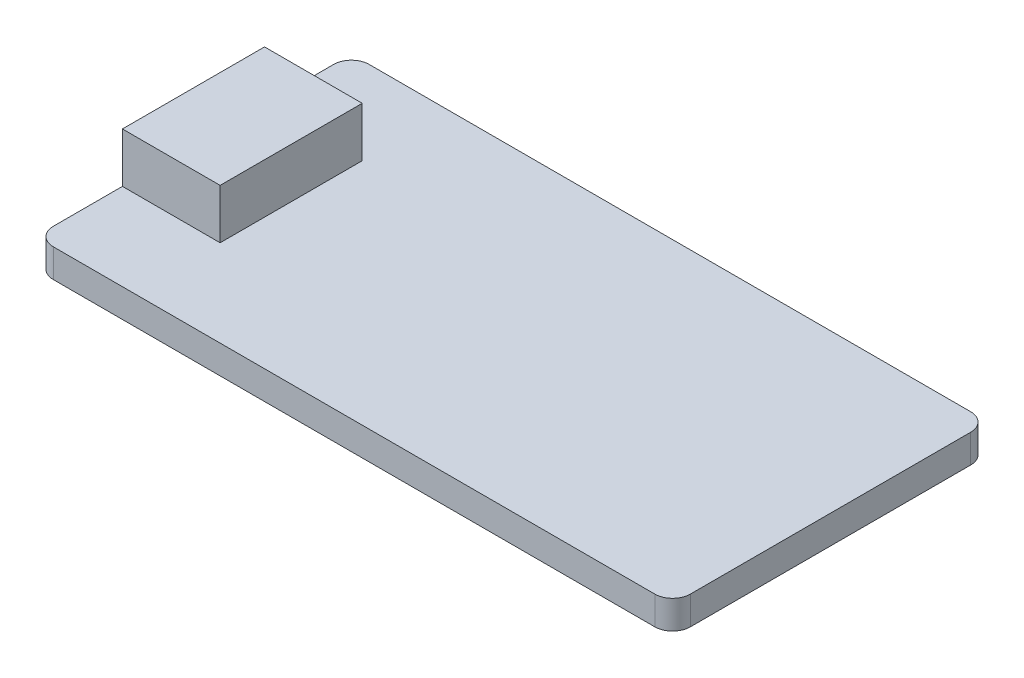
ISO-10303-21;
HEADER;
FILE_DESCRIPTION(('STEP AP214'),'2;1');
FILE_NAME('part.step','',(''),(''),'','','');
FILE_SCHEMA(('AUTOMOTIVE_DESIGN { 1 0 10303 214 1 1 1 1 }'));
ENDSEC;
DATA;
#1=APPLICATION_CONTEXT('core data for automotive mechanical design processes');
#2=APPLICATION_PROTOCOL_DEFINITION('international standard','automotive_design',2000,#1);
#3=PRODUCT_CONTEXT('',#1,'mechanical');
#4=PRODUCT('Part','Part','',(#3));
#5=PRODUCT_RELATED_PRODUCT_CATEGORY('part','',(#4));
#6=PRODUCT_DEFINITION_FORMATION('','',#4);
#7=PRODUCT_DEFINITION_CONTEXT('part definition',#1,'design');
#8=PRODUCT_DEFINITION('design','',#6,#7);
#9=PRODUCT_DEFINITION_SHAPE('','',#8);
#10=(LENGTH_UNIT() NAMED_UNIT(*) SI_UNIT(.MILLI.,.METRE.));
#11=(NAMED_UNIT(*) PLANE_ANGLE_UNIT() SI_UNIT($,.RADIAN.));
#12=(NAMED_UNIT(*) SI_UNIT($,.STERADIAN.) SOLID_ANGLE_UNIT());
#13=UNCERTAINTY_MEASURE_WITH_UNIT(LENGTH_MEASURE(1.E-05),#10,'distance_accuracy_value','');
#14=(GEOMETRIC_REPRESENTATION_CONTEXT(3) GLOBAL_UNCERTAINTY_ASSIGNED_CONTEXT((#13)) GLOBAL_UNIT_ASSIGNED_CONTEXT((#10,
#11,#12)) REPRESENTATION_CONTEXT('',''));
#15=CARTESIAN_POINT('',(0.,0.,0.));
#16=DIRECTION('',(0.,0.,1.));
#17=DIRECTION('',(1.,0.,0.));
#18=AXIS2_PLACEMENT_3D('',#15,#16,#17);
#19=CARTESIAN_POINT('',(0.,1.6,0.));
#20=DIRECTION('',(1.,0.,0.));
#21=DIRECTION('',(0.,0.,-1.));
#22=AXIS2_PLACEMENT_3D('',#19,#20,#21);
#23=PLANE('',#22);
#24=DIRECTION('',(0.,0.,1.));
#25=VECTOR('',#24,1.);
#26=CARTESIAN_POINT('',(0.,1.6,0.));
#27=LINE('',#26,#25);
#28=CARTESIAN_POINT('',(0.,1.6,-16.78));
#29=VERTEX_POINT('',#28);
#30=CARTESIAN_POINT('',(0.,1.6,-12.89));
#31=VERTEX_POINT('',#30);
#32=EDGE_CURVE('E159',#29,#31,#27,.T.);
#33=ORIENTED_EDGE('',*,*,#32,.F.);
#34=DIRECTION('',(0.,-1.,0.));
#35=VECTOR('',#34,1.);
#36=CARTESIAN_POINT('',(0.,1.6,-16.78));
#37=LINE('',#36,#35);
#38=CARTESIAN_POINT('',(0.,0.,-16.78));
#39=VERTEX_POINT('',#38);
#40=EDGE_CURVE('E177',#29,#39,#37,.T.);
#41=ORIENTED_EDGE('',*,*,#40,.T.);
#42=DIRECTION('',(0.,0.,1.));
#43=VECTOR('',#42,1.);
#44=CARTESIAN_POINT('',(0.,0.,0.));
#45=LINE('',#44,#43);
#46=CARTESIAN_POINT('',(0.,0.,-1.));
#47=VERTEX_POINT('',#46);
#48=EDGE_CURVE('E150',#39,#47,#45,.T.);
#49=ORIENTED_EDGE('',*,*,#48,.T.);
#50=DIRECTION('',(0.,-1.,0.));
#51=VECTOR('',#50,1.);
#52=CARTESIAN_POINT('',(0.,1.6,-1.));
#53=LINE('',#52,#51);
#54=CARTESIAN_POINT('',(0.,1.6,-1.));
#55=VERTEX_POINT('',#54);
#56=EDGE_CURVE('E167',#47,#55,#53,.F.);
#57=ORIENTED_EDGE('',*,*,#56,.T.);
#58=CARTESIAN_POINT('',(0.,1.6,-4.88999999999999));
#59=VERTEX_POINT('',#58);
#60=EDGE_CURVE('E149',#59,#55,#27,.T.);
#61=ORIENTED_EDGE('',*,*,#60,.F.);
#62=DIRECTION('',(0.,-1.,0.));
#63=VECTOR('',#62,1.);
#64=CARTESIAN_POINT('',(0.,4.4,-4.88999999999999));
#65=LINE('',#64,#63);
#66=CARTESIAN_POINT('',(0.,4.4,-4.88999999999999));
#67=VERTEX_POINT('',#66);
#68=EDGE_CURVE('E128',#67,#59,#65,.T.);
#69=ORIENTED_EDGE('',*,*,#68,.F.);
#70=DIRECTION('',(0.,0.,1.));
#71=VECTOR('',#70,1.);
#72=CARTESIAN_POINT('',(0.,4.4,-12.89));
#73=LINE('',#72,#71);
#74=CARTESIAN_POINT('',(0.,4.4,-12.89));
#75=VERTEX_POINT('',#74);
#76=EDGE_CURVE('E135',#75,#67,#73,.T.);
#77=ORIENTED_EDGE('',*,*,#76,.F.);
#78=DIRECTION('',(0.,-1.,0.));
#79=VECTOR('',#78,1.);
#80=CARTESIAN_POINT('',(0.,4.4,-12.89));
#81=LINE('',#80,#79);
#82=EDGE_CURVE('E235',#75,#31,#81,.T.);
#83=ORIENTED_EDGE('',*,*,#82,.T.);
#84=EDGE_LOOP('',(#33,#41,#49,#57,#61,#69,#77,#83));
#85=FACE_BOUND('',#84,.T.);
#86=ADVANCED_FACE('F33',(#85),#23,.F.);
#87=CARTESIAN_POINT('',(0.,1.6,0.));
#88=DIRECTION('',(0.,0.,-1.));
#89=DIRECTION('',(-1.,0.,0.));
#90=AXIS2_PLACEMENT_3D('',#87,#88,#89);
#91=PLANE('',#90);
#92=DIRECTION('',(1.,0.,0.));
#93=VECTOR('',#92,1.);
#94=CARTESIAN_POINT('',(0.,0.,0.));
#95=LINE('',#94,#93);
#96=CARTESIAN_POINT('',(1.,0.,0.));
#97=VERTEX_POINT('',#96);
#98=CARTESIAN_POINT('',(34.86,0.,0.));
#99=VERTEX_POINT('',#98);
#100=EDGE_CURVE('E153',#97,#99,#95,.T.);
#101=ORIENTED_EDGE('',*,*,#100,.T.);
#102=DIRECTION('',(0.,-1.,0.));
#103=VECTOR('',#102,1.);
#104=CARTESIAN_POINT('',(34.86,1.6,0.));
#105=LINE('',#104,#103);
#106=CARTESIAN_POINT('',(34.86,1.6,0.));
#107=VERTEX_POINT('',#106);
#108=EDGE_CURVE('E11',#99,#107,#105,.F.);
#109=ORIENTED_EDGE('',*,*,#108,.T.);
#110=DIRECTION('',(1.,0.,0.));
#111=VECTOR('',#110,1.);
#112=CARTESIAN_POINT('',(0.,1.6,0.));
#113=LINE('',#112,#111);
#114=CARTESIAN_POINT('',(1.,1.6,0.));
#115=VERTEX_POINT('',#114);
#116=EDGE_CURVE('E161',#115,#107,#113,.T.);
#117=ORIENTED_EDGE('',*,*,#116,.F.);
#118=DIRECTION('',(0.,-1.,0.));
#119=VECTOR('',#118,1.);
#120=CARTESIAN_POINT('',(1.,1.6,0.));
#121=LINE('',#120,#119);
#122=EDGE_CURVE('E41',#115,#97,#121,.T.);
#123=ORIENTED_EDGE('',*,*,#122,.T.);
#124=EDGE_LOOP('',(#101,#109,#117,#123));
#125=FACE_BOUND('',#124,.T.);
#126=ADVANCED_FACE('F208',(#125),#91,.F.);
#127=CARTESIAN_POINT('',(35.86,1.6,0.));
#128=DIRECTION('',(-1.,0.,0.));
#129=DIRECTION('',(0.,0.,1.));
#130=AXIS2_PLACEMENT_3D('',#127,#128,#129);
#131=PLANE('',#130);
#132=DIRECTION('',(0.,0.,-1.));
#133=VECTOR('',#132,1.);
#134=CARTESIAN_POINT('',(35.86,0.,0.));
#135=LINE('',#134,#133);
#136=CARTESIAN_POINT('',(35.86,0.,-1.));
#137=VERTEX_POINT('',#136);
#138=CARTESIAN_POINT('',(35.86,0.,-16.78));
#139=VERTEX_POINT('',#138);
#140=EDGE_CURVE('E171',#137,#139,#135,.T.);
#141=ORIENTED_EDGE('',*,*,#140,.T.);
#142=DIRECTION('',(0.,-1.,0.));
#143=VECTOR('',#142,1.);
#144=CARTESIAN_POINT('',(35.86,1.6,-16.78));
#145=LINE('',#144,#143);
#146=CARTESIAN_POINT('',(35.86,1.6,-16.78));
#147=VERTEX_POINT('',#146);
#148=EDGE_CURVE('E48',#139,#147,#145,.F.);
#149=ORIENTED_EDGE('',*,*,#148,.T.);
#150=DIRECTION('',(0.,0.,-1.));
#151=VECTOR('',#150,1.);
#152=CARTESIAN_POINT('',(35.86,1.6,0.));
#153=LINE('',#152,#151);
#154=CARTESIAN_POINT('',(35.86,1.6,-1.));
#155=VERTEX_POINT('',#154);
#156=EDGE_CURVE('E163',#155,#147,#153,.T.);
#157=ORIENTED_EDGE('',*,*,#156,.F.);
#158=DIRECTION('',(0.,-1.,0.));
#159=VECTOR('',#158,1.);
#160=CARTESIAN_POINT('',(35.86,1.6,-1.));
#161=LINE('',#160,#159);
#162=EDGE_CURVE('E200',#155,#137,#161,.T.);
#163=ORIENTED_EDGE('',*,*,#162,.T.);
#164=EDGE_LOOP('',(#141,#149,#157,#163));
#165=FACE_BOUND('',#164,.T.);
#166=ADVANCED_FACE('F219',(#165),#131,.F.);
#167=CARTESIAN_POINT('',(0.,1.6,-17.78));
#168=DIRECTION('',(0.,0.,1.));
#169=DIRECTION('',(1.,0.,0.));
#170=AXIS2_PLACEMENT_3D('',#167,#168,#169);
#171=PLANE('',#170);
#172=DIRECTION('',(-1.,0.,0.));
#173=VECTOR('',#172,1.);
#174=CARTESIAN_POINT('',(0.,0.,-17.78));
#175=LINE('',#174,#173);
#176=CARTESIAN_POINT('',(34.86,0.,-17.78));
#177=VERTEX_POINT('',#176);
#178=CARTESIAN_POINT('',(1.,0.,-17.78));
#179=VERTEX_POINT('',#178);
#180=EDGE_CURVE('E173',#177,#179,#175,.T.);
#181=ORIENTED_EDGE('',*,*,#180,.T.);
#182=DIRECTION('',(0.,-1.,0.));
#183=VECTOR('',#182,1.);
#184=CARTESIAN_POINT('',(1.,1.6,-17.78));
#185=LINE('',#184,#183);
#186=CARTESIAN_POINT('',(1.,1.6,-17.78));
#187=VERTEX_POINT('',#186);
#188=EDGE_CURVE('E191',#179,#187,#185,.F.);
#189=ORIENTED_EDGE('',*,*,#188,.T.);
#190=DIRECTION('',(-1.,0.,0.));
#191=VECTOR('',#190,1.);
#192=CARTESIAN_POINT('',(0.,1.6,-17.78));
#193=LINE('',#192,#191);
#194=CARTESIAN_POINT('',(34.86,1.6,-17.78));
#195=VERTEX_POINT('',#194);
#196=EDGE_CURVE('E165',#195,#187,#193,.T.);
#197=ORIENTED_EDGE('',*,*,#196,.F.);
#198=DIRECTION('',(0.,-1.,0.));
#199=VECTOR('',#198,1.);
#200=CARTESIAN_POINT('',(34.86,1.6,-17.78));
#201=LINE('',#200,#199);
#202=EDGE_CURVE('E188',#195,#177,#201,.T.);
#203=ORIENTED_EDGE('',*,*,#202,.T.);
#204=EDGE_LOOP('',(#181,#189,#197,#203));
#205=FACE_BOUND('',#204,.T.);
#206=ADVANCED_FACE('F228',(#205),#171,.F.);
#207=CARTESIAN_POINT('',(0.,1.6,0.));
#208=DIRECTION('',(0.,-1.,0.));
#209=DIRECTION('',(0.,0.,-1.));
#210=AXIS2_PLACEMENT_3D('',#207,#208,#209);
#211=PLANE('',#210);
#212=ORIENTED_EDGE('',*,*,#196,.T.);
#213=CARTESIAN_POINT('',(1.,1.6,-16.78));
#214=DIRECTION('',(0.,-1.,0.));
#215=DIRECTION('',(0.,0.,-1.));
#216=AXIS2_PLACEMENT_3D('',#213,#214,#215);
#217=CIRCLE('',#216,1.);
#218=EDGE_CURVE('E198',#187,#29,#217,.F.);
#219=ORIENTED_EDGE('',*,*,#218,.T.);
#220=ORIENTED_EDGE('',*,*,#32,.T.);
#221=DIRECTION('',(1.,0.,0.));
#222=VECTOR('',#221,1.);
#223=CARTESIAN_POINT('',(0.,1.6,-12.89));
#224=LINE('',#223,#222);
#225=CARTESIAN_POINT('',(5.5,1.6,-12.89));
#226=VERTEX_POINT('',#225);
#227=EDGE_CURVE('E144',#31,#226,#224,.T.);
#228=ORIENTED_EDGE('',*,*,#227,.T.);
#229=DIRECTION('',(0.,0.,1.));
#230=VECTOR('',#229,1.);
#231=CARTESIAN_POINT('',(5.5,1.6,-12.89));
#232=LINE('',#231,#230);
#233=CARTESIAN_POINT('',(5.5,1.6,-4.89));
#234=VERTEX_POINT('',#233);
#235=EDGE_CURVE('E239',#226,#234,#232,.T.);
#236=ORIENTED_EDGE('',*,*,#235,.T.);
#237=DIRECTION('',(1.,0.,0.));
#238=VECTOR('',#237,1.);
#239=CARTESIAN_POINT('',(0.,1.6,-4.88999999999999));
#240=LINE('',#239,#238);
#241=EDGE_CURVE('E245',#59,#234,#240,.T.);
#242=ORIENTED_EDGE('',*,*,#241,.F.);
#243=ORIENTED_EDGE('',*,*,#60,.T.);
#244=CARTESIAN_POINT('',(1.,1.6,-1.));
#245=DIRECTION('',(0.,-1.,0.));
#246=DIRECTION('',(0.,0.,-1.));
#247=AXIS2_PLACEMENT_3D('',#244,#245,#246);
#248=CIRCLE('',#247,1.);
#249=EDGE_CURVE('E193',#55,#115,#248,.F.);
#250=ORIENTED_EDGE('',*,*,#249,.T.);
#251=ORIENTED_EDGE('',*,*,#116,.T.);
#252=CARTESIAN_POINT('',(34.86,1.6,-1.));
#253=DIRECTION('',(0.,-1.,0.));
#254=DIRECTION('',(0.,0.,-1.));
#255=AXIS2_PLACEMENT_3D('',#252,#253,#254);
#256=CIRCLE('',#255,1.);
#257=EDGE_CURVE('E55',#107,#155,#256,.F.);
#258=ORIENTED_EDGE('',*,*,#257,.T.);
#259=ORIENTED_EDGE('',*,*,#156,.T.);
#260=CARTESIAN_POINT('',(34.86,1.6,-16.78));
#261=DIRECTION('',(0.,-1.,0.));
#262=DIRECTION('',(0.,0.,-1.));
#263=AXIS2_PLACEMENT_3D('',#260,#261,#262);
#264=CIRCLE('',#263,1.);
#265=EDGE_CURVE('E196',#147,#195,#264,.F.);
#266=ORIENTED_EDGE('',*,*,#265,.T.);
#267=EDGE_LOOP('',(#212,#219,#220,#228,#236,#242,#243,#250,#251,#258,#259,#266));
#268=FACE_BOUND('',#267,.T.);
#269=ADVANCED_FACE('F221',(#268),#211,.F.);
#270=CARTESIAN_POINT('',(0.,0.,0.));
#271=DIRECTION('',(0.,-1.,0.));
#272=DIRECTION('',(0.,0.,-1.));
#273=AXIS2_PLACEMENT_3D('',#270,#271,#272);
#274=PLANE('',#273);
#275=ORIENTED_EDGE('',*,*,#48,.F.);
#276=CARTESIAN_POINT('',(1.,0.,-16.78));
#277=DIRECTION('',(0.,-1.,0.));
#278=DIRECTION('',(0.,0.,-1.));
#279=AXIS2_PLACEMENT_3D('',#276,#277,#278);
#280=CIRCLE('',#279,1.);
#281=EDGE_CURVE('E186',#39,#179,#280,.T.);
#282=ORIENTED_EDGE('',*,*,#281,.T.);
#283=ORIENTED_EDGE('',*,*,#180,.F.);
#284=CARTESIAN_POINT('',(34.86,0.,-16.78));
#285=DIRECTION('',(0.,-1.,0.));
#286=DIRECTION('',(0.,0.,-1.));
#287=AXIS2_PLACEMENT_3D('',#284,#285,#286);
#288=CIRCLE('',#287,1.);
#289=EDGE_CURVE('E184',#177,#139,#288,.T.);
#290=ORIENTED_EDGE('',*,*,#289,.T.);
#291=ORIENTED_EDGE('',*,*,#140,.F.);
#292=CARTESIAN_POINT('',(34.86,0.,-1.));
#293=DIRECTION('',(0.,-1.,0.));
#294=DIRECTION('',(0.,0.,-1.));
#295=AXIS2_PLACEMENT_3D('',#292,#293,#294);
#296=CIRCLE('',#295,1.);
#297=EDGE_CURVE('E182',#137,#99,#296,.T.);
#298=ORIENTED_EDGE('',*,*,#297,.T.);
#299=ORIENTED_EDGE('',*,*,#100,.F.);
#300=CARTESIAN_POINT('',(1.,0.,-1.));
#301=DIRECTION('',(0.,-1.,0.));
#302=DIRECTION('',(0.,0.,-1.));
#303=AXIS2_PLACEMENT_3D('',#300,#301,#302);
#304=CIRCLE('',#303,1.);
#305=EDGE_CURVE('E180',#97,#47,#304,.T.);
#306=ORIENTED_EDGE('',*,*,#305,.T.);
#307=EDGE_LOOP('',(#275,#282,#283,#290,#291,#298,#299,#306));
#308=FACE_BOUND('',#307,.T.);
#309=ADVANCED_FACE('F214',(#308),#274,.T.);
#310=CARTESIAN_POINT('',(0.,4.4,-4.88999999999999));
#311=DIRECTION('',(0.,0.,-1.));
#312=DIRECTION('',(-1.,0.,0.));
#313=AXIS2_PLACEMENT_3D('',#310,#311,#312);
#314=PLANE('',#313);
#315=ORIENTED_EDGE('',*,*,#241,.T.);
#316=DIRECTION('',(0.,-1.,0.));
#317=VECTOR('',#316,1.);
#318=CARTESIAN_POINT('',(5.5,4.4,-4.89));
#319=LINE('',#318,#317);
#320=CARTESIAN_POINT('',(5.5,4.4,-4.89));
#321=VERTEX_POINT('',#320);
#322=EDGE_CURVE('E130',#321,#234,#319,.T.);
#323=ORIENTED_EDGE('',*,*,#322,.F.);
#324=DIRECTION('',(1.,0.,0.));
#325=VECTOR('',#324,1.);
#326=CARTESIAN_POINT('',(0.,4.4,-4.88999999999999));
#327=LINE('',#326,#325);
#328=EDGE_CURVE('E123',#67,#321,#327,.T.);
#329=ORIENTED_EDGE('',*,*,#328,.F.);
#330=ORIENTED_EDGE('',*,*,#68,.T.);
#331=EDGE_LOOP('',(#315,#323,#329,#330));
#332=FACE_BOUND('',#331,.T.);
#333=ADVANCED_FACE('F126',(#332),#314,.F.);
#334=CARTESIAN_POINT('',(5.5,4.4,-12.89));
#335=DIRECTION('',(1.,0.,0.));
#336=DIRECTION('',(0.,0.,-1.));
#337=AXIS2_PLACEMENT_3D('',#334,#335,#336);
#338=PLANE('',#337);
#339=ORIENTED_EDGE('',*,*,#235,.F.);
#340=DIRECTION('',(0.,-1.,0.));
#341=VECTOR('',#340,1.);
#342=CARTESIAN_POINT('',(5.5,4.4,-12.89));
#343=LINE('',#342,#341);
#344=CARTESIAN_POINT('',(5.5,4.4,-12.89));
#345=VERTEX_POINT('',#344);
#346=EDGE_CURVE('E155',#345,#226,#343,.T.);
#347=ORIENTED_EDGE('',*,*,#346,.F.);
#348=DIRECTION('',(0.,0.,1.));
#349=VECTOR('',#348,1.);
#350=CARTESIAN_POINT('',(5.5,4.4,-12.89));
#351=LINE('',#350,#349);
#352=EDGE_CURVE('E134',#345,#321,#351,.T.);
#353=ORIENTED_EDGE('',*,*,#352,.T.);
#354=ORIENTED_EDGE('',*,*,#322,.T.);
#355=EDGE_LOOP('',(#339,#347,#353,#354));
#356=FACE_BOUND('',#355,.T.);
#357=ADVANCED_FACE('F244',(#356),#338,.T.);
#358=CARTESIAN_POINT('',(0.,4.4,-12.89));
#359=DIRECTION('',(0.,0.,-1.));
#360=DIRECTION('',(-1.,0.,0.));
#361=AXIS2_PLACEMENT_3D('',#358,#359,#360);
#362=PLANE('',#361);
#363=ORIENTED_EDGE('',*,*,#227,.F.);
#364=ORIENTED_EDGE('',*,*,#82,.F.);
#365=DIRECTION('',(1.,0.,0.));
#366=VECTOR('',#365,1.);
#367=CARTESIAN_POINT('',(0.,4.4,-12.89));
#368=LINE('',#367,#366);
#369=EDGE_CURVE('E141',#75,#345,#368,.T.);
#370=ORIENTED_EDGE('',*,*,#369,.T.);
#371=ORIENTED_EDGE('',*,*,#346,.T.);
#372=EDGE_LOOP('',(#363,#364,#370,#371));
#373=FACE_BOUND('',#372,.T.);
#374=ADVANCED_FACE('F242',(#373),#362,.T.);
#375=CARTESIAN_POINT('',(0.,4.4,0.));
#376=DIRECTION('',(0.,1.,0.));
#377=DIRECTION('',(0.,0.,1.));
#378=AXIS2_PLACEMENT_3D('',#375,#376,#377);
#379=PLANE('',#378);
#380=ORIENTED_EDGE('',*,*,#76,.T.);
#381=ORIENTED_EDGE('',*,*,#328,.T.);
#382=ORIENTED_EDGE('',*,*,#352,.F.);
#383=ORIENTED_EDGE('',*,*,#369,.F.);
#384=EDGE_LOOP('',(#380,#381,#382,#383));
#385=FACE_BOUND('',#384,.T.);
#386=ADVANCED_FACE('F139',(#385),#379,.T.);
#387=CARTESIAN_POINT('',(1.,1.6,-16.78));
#388=DIRECTION('',(0.,-1.,0.));
#389=DIRECTION('',(0.,0.,-1.));
#390=AXIS2_PLACEMENT_3D('',#387,#388,#389);
#391=CYLINDRICAL_SURFACE('',#390,1.);
#392=ORIENTED_EDGE('',*,*,#218,.F.);
#393=ORIENTED_EDGE('',*,*,#188,.F.);
#394=ORIENTED_EDGE('',*,*,#281,.F.);
#395=ORIENTED_EDGE('',*,*,#40,.F.);
#396=EDGE_LOOP('',(#392,#393,#394,#395));
#397=FACE_BOUND('',#396,.T.);
#398=ADVANCED_FACE('F233',(#397),#391,.T.);
#399=CARTESIAN_POINT('',(34.86,1.6,-16.78));
#400=DIRECTION('',(0.,-1.,0.));
#401=DIRECTION('',(0.,0.,-1.));
#402=AXIS2_PLACEMENT_3D('',#399,#400,#401);
#403=CYLINDRICAL_SURFACE('',#402,1.);
#404=ORIENTED_EDGE('',*,*,#265,.F.);
#405=ORIENTED_EDGE('',*,*,#148,.F.);
#406=ORIENTED_EDGE('',*,*,#289,.F.);
#407=ORIENTED_EDGE('',*,*,#202,.F.);
#408=EDGE_LOOP('',(#404,#405,#406,#407));
#409=FACE_BOUND('',#408,.T.);
#410=ADVANCED_FACE('F225',(#409),#403,.T.);
#411=CARTESIAN_POINT('',(34.86,1.6,-1.));
#412=DIRECTION('',(0.,-1.,0.));
#413=DIRECTION('',(0.,0.,-1.));
#414=AXIS2_PLACEMENT_3D('',#411,#412,#413);
#415=CYLINDRICAL_SURFACE('',#414,1.);
#416=ORIENTED_EDGE('',*,*,#257,.F.);
#417=ORIENTED_EDGE('',*,*,#108,.F.);
#418=ORIENTED_EDGE('',*,*,#297,.F.);
#419=ORIENTED_EDGE('',*,*,#162,.F.);
#420=EDGE_LOOP('',(#416,#417,#418,#419));
#421=FACE_BOUND('',#420,.T.);
#422=ADVANCED_FACE('F218',(#421),#415,.T.);
#423=CARTESIAN_POINT('',(1.,1.6,-1.));
#424=DIRECTION('',(0.,-1.,0.));
#425=DIRECTION('',(0.,0.,-1.));
#426=AXIS2_PLACEMENT_3D('',#423,#424,#425);
#427=CYLINDRICAL_SURFACE('',#426,1.);
#428=ORIENTED_EDGE('',*,*,#249,.F.);
#429=ORIENTED_EDGE('',*,*,#56,.F.);
#430=ORIENTED_EDGE('',*,*,#305,.F.);
#431=ORIENTED_EDGE('',*,*,#122,.F.);
#432=EDGE_LOOP('',(#428,#429,#430,#431));
#433=FACE_BOUND('',#432,.T.);
#434=ADVANCED_FACE('F35',(#433),#427,.T.);
#435=CLOSED_SHELL('',(#86,#126,#166,#206,#269,#309,#333,#357,#374,#386,#398,#410,#422,#434));
#436=MANIFOLD_SOLID_BREP('B2',#435);
#437=ADVANCED_BREP_SHAPE_REPRESENTATION('',(#18,#436),#14);
#438=SHAPE_DEFINITION_REPRESENTATION(#9,#437);
ENDSEC;
END-ISO-10303-21;
